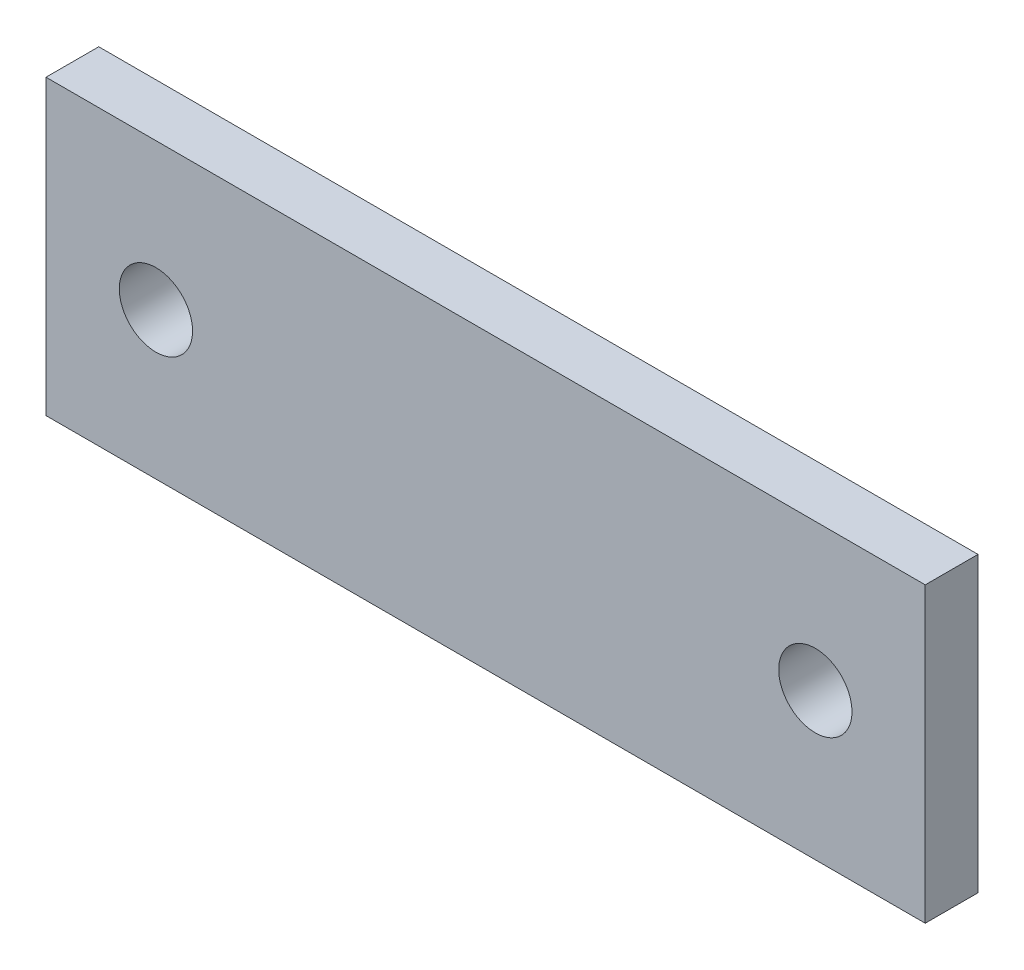
ISO-10303-21;
HEADER;
FILE_DESCRIPTION(('STEP AP214'),'2;1');
FILE_NAME('part.step','',(''),(''),'','','');
FILE_SCHEMA(('AUTOMOTIVE_DESIGN { 1 0 10303 214 1 1 1 1 }'));
ENDSEC;
DATA;
#1=APPLICATION_CONTEXT('core data for automotive mechanical design processes');
#2=APPLICATION_PROTOCOL_DEFINITION('international standard','automotive_design',2000,#1);
#3=PRODUCT_CONTEXT('',#1,'mechanical');
#4=PRODUCT('Part','Part','',(#3));
#5=PRODUCT_RELATED_PRODUCT_CATEGORY('part','',(#4));
#6=PRODUCT_DEFINITION_FORMATION('','',#4);
#7=PRODUCT_DEFINITION_CONTEXT('part definition',#1,'design');
#8=PRODUCT_DEFINITION('design','',#6,#7);
#9=PRODUCT_DEFINITION_SHAPE('','',#8);
#10=(LENGTH_UNIT() NAMED_UNIT(*) SI_UNIT(.MILLI.,.METRE.));
#11=(NAMED_UNIT(*) PLANE_ANGLE_UNIT() SI_UNIT($,.RADIAN.));
#12=(NAMED_UNIT(*) SI_UNIT($,.STERADIAN.) SOLID_ANGLE_UNIT());
#13=UNCERTAINTY_MEASURE_WITH_UNIT(LENGTH_MEASURE(1.E-05),#10,'distance_accuracy_value','');
#14=(GEOMETRIC_REPRESENTATION_CONTEXT(3) GLOBAL_UNCERTAINTY_ASSIGNED_CONTEXT((#13)) GLOBAL_UNIT_ASSIGNED_CONTEXT((#10,
#11,#12)) REPRESENTATION_CONTEXT('',''));
#15=CARTESIAN_POINT('',(0.,0.,0.));
#16=DIRECTION('',(0.,0.,1.));
#17=DIRECTION('',(1.,0.,0.));
#18=AXIS2_PLACEMENT_3D('',#15,#16,#17);
#19=CARTESIAN_POINT('',(0.,0.,2.286));
#20=DIRECTION('',(0.,0.,1.));
#21=DIRECTION('',(1.,0.,0.));
#22=AXIS2_PLACEMENT_3D('',#19,#20,#21);
#23=PLANE('',#22);
#24=CARTESIAN_POINT('',(-28.575,0.,2.286));
#25=DIRECTION('',(0.,0.,1.));
#26=DIRECTION('',(1.,0.,0.));
#27=AXIS2_PLACEMENT_3D('',#24,#25,#26);
#28=CIRCLE('',#27,3.175);
#29=CARTESIAN_POINT('',(-25.4,0.,2.286));
#30=VERTEX_POINT('',#29);
#31=EDGE_CURVE('E104',#30,#30,#28,.T.);
#32=ORIENTED_EDGE('',*,*,#31,.F.);
#33=EDGE_LOOP('',(#32));
#34=FACE_BOUND('',#33,.T.);
#35=DIRECTION('',(0.,-1.,0.));
#36=VECTOR('',#35,1.);
#37=CARTESIAN_POINT('',(-38.1,12.7,2.286));
#38=LINE('',#37,#36);
#39=CARTESIAN_POINT('',(-38.1,12.7,2.286));
#40=VERTEX_POINT('',#39);
#41=CARTESIAN_POINT('',(-38.1,-12.7,2.286));
#42=VERTEX_POINT('',#41);
#43=EDGE_CURVE('E107',#40,#42,#38,.T.);
#44=ORIENTED_EDGE('',*,*,#43,.T.);
#45=DIRECTION('',(1.,0.,0.));
#46=VECTOR('',#45,1.);
#47=CARTESIAN_POINT('',(-38.1,-12.7,2.286));
#48=LINE('',#47,#46);
#49=CARTESIAN_POINT('',(38.1,-12.7,2.286));
#50=VERTEX_POINT('',#49);
#51=EDGE_CURVE('E76',#42,#50,#48,.T.);
#52=ORIENTED_EDGE('',*,*,#51,.T.);
#53=DIRECTION('',(0.,1.,0.));
#54=VECTOR('',#53,1.);
#55=CARTESIAN_POINT('',(38.1,12.7,2.286));
#56=LINE('',#55,#54);
#57=CARTESIAN_POINT('',(38.1,12.7,2.286));
#58=VERTEX_POINT('',#57);
#59=EDGE_CURVE('E52',#50,#58,#56,.T.);
#60=ORIENTED_EDGE('',*,*,#59,.T.);
#61=DIRECTION('',(-1.,0.,0.));
#62=VECTOR('',#61,1.);
#63=CARTESIAN_POINT('',(-38.1,12.7,2.286));
#64=LINE('',#63,#62);
#65=EDGE_CURVE('E47',#58,#40,#64,.T.);
#66=ORIENTED_EDGE('',*,*,#65,.T.);
#67=EDGE_LOOP('',(#44,#52,#60,#66));
#68=FACE_BOUND('',#67,.T.);
#69=CARTESIAN_POINT('',(28.575,0.,2.286));
#70=DIRECTION('',(0.,0.,1.));
#71=DIRECTION('',(1.,0.,0.));
#72=AXIS2_PLACEMENT_3D('',#69,#70,#71);
#73=CIRCLE('',#72,3.175);
#74=CARTESIAN_POINT('',(31.75,0.,2.286));
#75=VERTEX_POINT('',#74);
#76=EDGE_CURVE('E101',#75,#75,#73,.T.);
#77=ORIENTED_EDGE('',*,*,#76,.F.);
#78=EDGE_LOOP('',(#77));
#79=FACE_BOUND('',#78,.T.);
#80=ADVANCED_FACE('F32',(#34,#68,#79),#23,.T.);
#81=CARTESIAN_POINT('',(-38.1,12.7,2.286));
#82=DIRECTION('',(1.,0.,0.));
#83=DIRECTION('',(0.,1.,0.));
#84=AXIS2_PLACEMENT_3D('',#81,#82,#83);
#85=PLANE('',#84);
#86=DIRECTION('',(0.,0.,-1.));
#87=VECTOR('',#86,1.);
#88=CARTESIAN_POINT('',(-38.1,12.7,2.286));
#89=LINE('',#88,#87);
#90=CARTESIAN_POINT('',(-38.1,12.7,-2.286));
#91=VERTEX_POINT('',#90);
#92=EDGE_CURVE('E90',#40,#91,#89,.T.);
#93=ORIENTED_EDGE('',*,*,#92,.T.);
#94=DIRECTION('',(0.,-1.,0.));
#95=VECTOR('',#94,1.);
#96=CARTESIAN_POINT('',(-38.1,12.7,-2.286));
#97=LINE('',#96,#95);
#98=CARTESIAN_POINT('',(-38.1,-12.7,-2.286));
#99=VERTEX_POINT('',#98);
#100=EDGE_CURVE('E85',#91,#99,#97,.T.);
#101=ORIENTED_EDGE('',*,*,#100,.T.);
#102=DIRECTION('',(0.,0.,-1.));
#103=VECTOR('',#102,1.);
#104=CARTESIAN_POINT('',(-38.1,-12.7,2.286));
#105=LINE('',#104,#103);
#106=EDGE_CURVE('E11',#42,#99,#105,.T.);
#107=ORIENTED_EDGE('',*,*,#106,.F.);
#108=ORIENTED_EDGE('',*,*,#43,.F.);
#109=EDGE_LOOP('',(#93,#101,#107,#108));
#110=FACE_BOUND('',#109,.T.);
#111=ADVANCED_FACE('F34',(#110),#85,.F.);
#112=CARTESIAN_POINT('',(-38.1,-12.7,2.286));
#113=DIRECTION('',(0.,1.,0.));
#114=DIRECTION('',(0.,0.,1.));
#115=AXIS2_PLACEMENT_3D('',#112,#113,#114);
#116=PLANE('',#115);
#117=ORIENTED_EDGE('',*,*,#106,.T.);
#118=DIRECTION('',(1.,0.,0.));
#119=VECTOR('',#118,1.);
#120=CARTESIAN_POINT('',(-38.1,-12.7,-2.286));
#121=LINE('',#120,#119);
#122=CARTESIAN_POINT('',(38.1,-12.7,-2.286));
#123=VERTEX_POINT('',#122);
#124=EDGE_CURVE('E75',#99,#123,#121,.T.);
#125=ORIENTED_EDGE('',*,*,#124,.T.);
#126=DIRECTION('',(0.,0.,-1.));
#127=VECTOR('',#126,1.);
#128=CARTESIAN_POINT('',(38.1,-12.7,2.286));
#129=LINE('',#128,#127);
#130=EDGE_CURVE('E40',#50,#123,#129,.T.);
#131=ORIENTED_EDGE('',*,*,#130,.F.);
#132=ORIENTED_EDGE('',*,*,#51,.F.);
#133=EDGE_LOOP('',(#117,#125,#131,#132));
#134=FACE_BOUND('',#133,.T.);
#135=ADVANCED_FACE('F73',(#134),#116,.F.);
#136=CARTESIAN_POINT('',(38.1,12.7,2.286));
#137=DIRECTION('',(-1.,0.,0.));
#138=DIRECTION('',(0.,-1.,0.));
#139=AXIS2_PLACEMENT_3D('',#136,#137,#138);
#140=PLANE('',#139);
#141=ORIENTED_EDGE('',*,*,#130,.T.);
#142=DIRECTION('',(0.,1.,0.));
#143=VECTOR('',#142,1.);
#144=CARTESIAN_POINT('',(38.1,12.7,-2.286));
#145=LINE('',#144,#143);
#146=CARTESIAN_POINT('',(38.1,12.7,-2.286));
#147=VERTEX_POINT('',#146);
#148=EDGE_CURVE('E88',#123,#147,#145,.T.);
#149=ORIENTED_EDGE('',*,*,#148,.T.);
#150=DIRECTION('',(0.,0.,-1.));
#151=VECTOR('',#150,1.);
#152=CARTESIAN_POINT('',(38.1,12.7,2.286));
#153=LINE('',#152,#151);
#154=EDGE_CURVE('E113',#58,#147,#153,.T.);
#155=ORIENTED_EDGE('',*,*,#154,.F.);
#156=ORIENTED_EDGE('',*,*,#59,.F.);
#157=EDGE_LOOP('',(#141,#149,#155,#156));
#158=FACE_BOUND('',#157,.T.);
#159=ADVANCED_FACE('F115',(#158),#140,.F.);
#160=CARTESIAN_POINT('',(-38.1,12.7,2.286));
#161=DIRECTION('',(0.,-1.,0.));
#162=DIRECTION('',(0.,0.,-1.));
#163=AXIS2_PLACEMENT_3D('',#160,#161,#162);
#164=PLANE('',#163);
#165=ORIENTED_EDGE('',*,*,#154,.T.);
#166=DIRECTION('',(-1.,0.,0.));
#167=VECTOR('',#166,1.);
#168=CARTESIAN_POINT('',(-38.1,12.7,-2.286));
#169=LINE('',#168,#167);
#170=EDGE_CURVE('E99',#147,#91,#169,.T.);
#171=ORIENTED_EDGE('',*,*,#170,.T.);
#172=ORIENTED_EDGE('',*,*,#92,.F.);
#173=ORIENTED_EDGE('',*,*,#65,.F.);
#174=EDGE_LOOP('',(#165,#171,#172,#173));
#175=FACE_BOUND('',#174,.T.);
#176=ADVANCED_FACE('F117',(#175),#164,.F.);
#177=CARTESIAN_POINT('',(-28.575,0.,2.286));
#178=DIRECTION('',(0.,0.,-1.));
#179=DIRECTION('',(-1.,0.,0.));
#180=AXIS2_PLACEMENT_3D('',#177,#178,#179);
#181=CYLINDRICAL_SURFACE('',#180,3.175);
#182=ORIENTED_EDGE('',*,*,#31,.T.);
#183=EDGE_LOOP('',(#182));
#184=FACE_BOUND('',#183,.T.);
#185=CARTESIAN_POINT('',(-28.575,0.,-2.286));
#186=DIRECTION('',(0.,0.,1.));
#187=DIRECTION('',(1.,0.,0.));
#188=AXIS2_PLACEMENT_3D('',#185,#186,#187);
#189=CIRCLE('',#188,3.175);
#190=CARTESIAN_POINT('',(-25.4,0.,-2.286));
#191=VERTEX_POINT('',#190);
#192=EDGE_CURVE('E91',#191,#191,#189,.T.);
#193=ORIENTED_EDGE('',*,*,#192,.F.);
#194=EDGE_LOOP('',(#193));
#195=FACE_BOUND('',#194,.T.);
#196=ADVANCED_FACE('F127',(#184,#195),#181,.F.);
#197=CARTESIAN_POINT('',(28.575,0.,2.286));
#198=DIRECTION('',(0.,0.,-1.));
#199=DIRECTION('',(-1.,0.,0.));
#200=AXIS2_PLACEMENT_3D('',#197,#198,#199);
#201=CYLINDRICAL_SURFACE('',#200,3.175);
#202=ORIENTED_EDGE('',*,*,#76,.T.);
#203=EDGE_LOOP('',(#202));
#204=FACE_BOUND('',#203,.T.);
#205=CARTESIAN_POINT('',(28.575,0.,-2.286));
#206=DIRECTION('',(0.,0.,1.));
#207=DIRECTION('',(1.,0.,0.));
#208=AXIS2_PLACEMENT_3D('',#205,#206,#207);
#209=CIRCLE('',#208,3.175);
#210=CARTESIAN_POINT('',(31.75,0.,-2.286));
#211=VERTEX_POINT('',#210);
#212=EDGE_CURVE('E94',#211,#211,#209,.T.);
#213=ORIENTED_EDGE('',*,*,#212,.F.);
#214=EDGE_LOOP('',(#213));
#215=FACE_BOUND('',#214,.T.);
#216=ADVANCED_FACE('F124',(#204,#215),#201,.F.);
#217=CARTESIAN_POINT('',(0.,0.,-2.286));
#218=DIRECTION('',(0.,0.,1.));
#219=DIRECTION('',(1.,0.,0.));
#220=AXIS2_PLACEMENT_3D('',#217,#218,#219);
#221=PLANE('',#220);
#222=ORIENTED_EDGE('',*,*,#212,.T.);
#223=EDGE_LOOP('',(#222));
#224=FACE_BOUND('',#223,.T.);
#225=ORIENTED_EDGE('',*,*,#192,.T.);
#226=EDGE_LOOP('',(#225));
#227=FACE_BOUND('',#226,.T.);
#228=ORIENTED_EDGE('',*,*,#100,.F.);
#229=ORIENTED_EDGE('',*,*,#170,.F.);
#230=ORIENTED_EDGE('',*,*,#148,.F.);
#231=ORIENTED_EDGE('',*,*,#124,.F.);
#232=EDGE_LOOP('',(#228,#229,#230,#231));
#233=FACE_BOUND('',#232,.T.);
#234=ADVANCED_FACE('F83',(#224,#227,#233),#221,.F.);
#235=CLOSED_SHELL('',(#80,#111,#135,#159,#176,#196,#216,#234));
#236=MANIFOLD_SOLID_BREP('B2',#235);
#237=ADVANCED_BREP_SHAPE_REPRESENTATION('',(#18,#236),#14);
#238=SHAPE_DEFINITION_REPRESENTATION(#9,#237);
ENDSEC;
END-ISO-10303-21;
